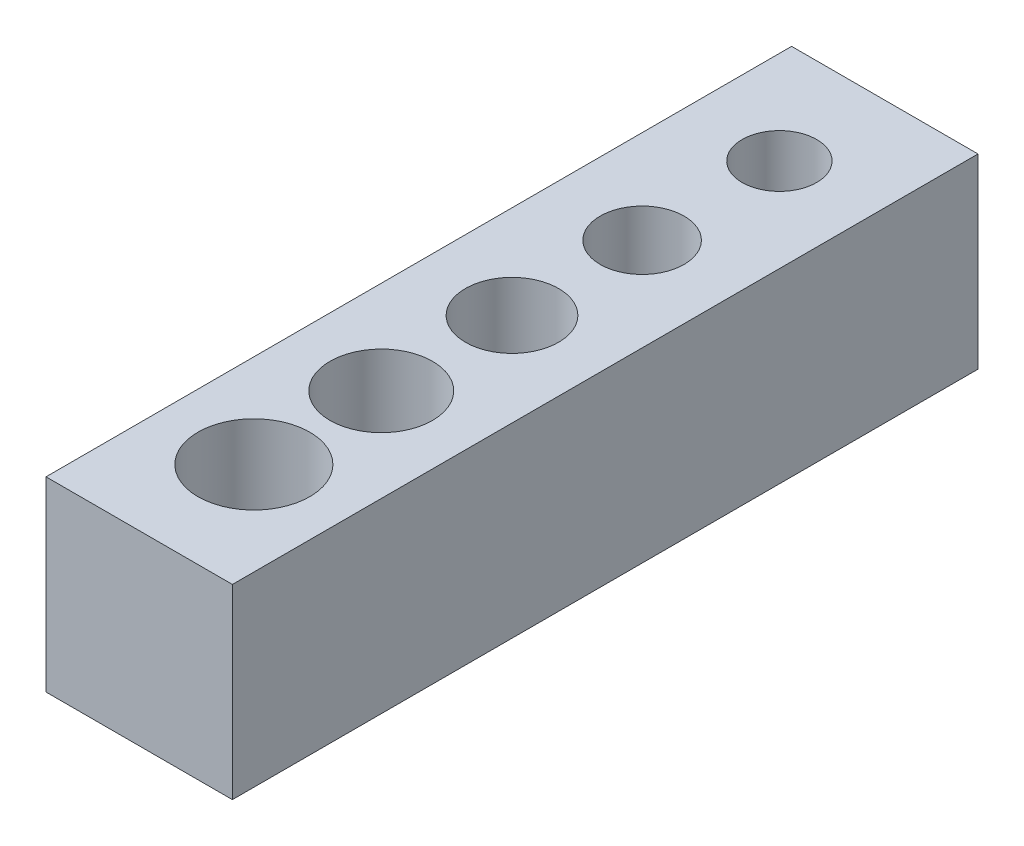
ISO-10303-21;
HEADER;
FILE_DESCRIPTION(('STEP AP214'),'2;1');
FILE_NAME('part.step','',(''),(''),'','','');
FILE_SCHEMA(('AUTOMOTIVE_DESIGN { 1 0 10303 214 1 1 1 1 }'));
ENDSEC;
DATA;
#1=APPLICATION_CONTEXT('core data for automotive mechanical design processes');
#2=APPLICATION_PROTOCOL_DEFINITION('international standard','automotive_design',2000,#1);
#3=PRODUCT_CONTEXT('',#1,'mechanical');
#4=PRODUCT('Part','Part','',(#3));
#5=PRODUCT_RELATED_PRODUCT_CATEGORY('part','',(#4));
#6=PRODUCT_DEFINITION_FORMATION('','',#4);
#7=PRODUCT_DEFINITION_CONTEXT('part definition',#1,'design');
#8=PRODUCT_DEFINITION('design','',#6,#7);
#9=PRODUCT_DEFINITION_SHAPE('','',#8);
#10=(LENGTH_UNIT() NAMED_UNIT(*) SI_UNIT(.MILLI.,.METRE.));
#11=(NAMED_UNIT(*) PLANE_ANGLE_UNIT() SI_UNIT($,.RADIAN.));
#12=(NAMED_UNIT(*) SI_UNIT($,.STERADIAN.) SOLID_ANGLE_UNIT());
#13=UNCERTAINTY_MEASURE_WITH_UNIT(LENGTH_MEASURE(1.E-05),#10,'distance_accuracy_value','');
#14=(GEOMETRIC_REPRESENTATION_CONTEXT(3) GLOBAL_UNCERTAINTY_ASSIGNED_CONTEXT((#13)) GLOBAL_UNIT_ASSIGNED_CONTEXT((#10,
#11,#12)) REPRESENTATION_CONTEXT('',''));
#15=CARTESIAN_POINT('',(0.,0.,0.));
#16=DIRECTION('',(0.,0.,1.));
#17=DIRECTION('',(1.,0.,0.));
#18=AXIS2_PLACEMENT_3D('',#15,#16,#17);
#19=CARTESIAN_POINT('',(0.,10.,0.));
#20=DIRECTION('',(0.,-1.,0.));
#21=DIRECTION('',(0.,0.,-1.));
#22=AXIS2_PLACEMENT_3D('',#19,#20,#21);
#23=PLANE('',#22);
#24=CARTESIAN_POINT('',(0.,10.,-14.3453995567029));
#25=DIRECTION('',(0.,1.,0.));
#26=DIRECTION('',(0.,0.,1.));
#27=AXIS2_PLACEMENT_3D('',#24,#25,#26);
#28=CIRCLE('',#27,2.);
#29=CARTESIAN_POINT('',(0.,10.,-12.3453995567029));
#30=VERTEX_POINT('',#29);
#31=EDGE_CURVE('E129',#30,#30,#28,.T.);
#32=ORIENTED_EDGE('',*,*,#31,.F.);
#33=EDGE_LOOP('',(#32));
#34=FACE_BOUND('',#33,.T.);
#35=CARTESIAN_POINT('',(0.,10.,-6.98108225755334));
#36=DIRECTION('',(0.,1.,0.));
#37=DIRECTION('',(0.,0.,1.));
#38=AXIS2_PLACEMENT_3D('',#35,#36,#37);
#39=CIRCLE('',#38,2.25);
#40=CARTESIAN_POINT('',(0.,10.,-4.73108225755334));
#41=VERTEX_POINT('',#40);
#42=EDGE_CURVE('E117',#41,#41,#39,.T.);
#43=ORIENTED_EDGE('',*,*,#42,.F.);
#44=EDGE_LOOP('',(#43));
#45=FACE_BOUND('',#44,.T.);
#46=DIRECTION('',(0.,0.,-1.));
#47=VECTOR('',#46,1.);
#48=CARTESIAN_POINT('',(5.,10.,20.));
#49=LINE('',#48,#47);
#50=CARTESIAN_POINT('',(5.,10.,20.));
#51=VERTEX_POINT('',#50);
#52=CARTESIAN_POINT('',(5.,10.,-20.));
#53=VERTEX_POINT('',#52);
#54=EDGE_CURVE('E87',#51,#53,#49,.T.);
#55=ORIENTED_EDGE('',*,*,#54,.T.);
#56=DIRECTION('',(-1.,0.,0.));
#57=VECTOR('',#56,1.);
#58=CARTESIAN_POINT('',(-5.,10.,-20.));
#59=LINE('',#58,#57);
#60=CARTESIAN_POINT('',(-5.,10.,-20.));
#61=VERTEX_POINT('',#60);
#62=EDGE_CURVE('E82',#53,#61,#59,.T.);
#63=ORIENTED_EDGE('',*,*,#62,.T.);
#64=DIRECTION('',(0.,0.,1.));
#65=VECTOR('',#64,1.);
#66=CARTESIAN_POINT('',(-5.,10.,20.));
#67=LINE('',#66,#65);
#68=CARTESIAN_POINT('',(-5.,10.,20.));
#69=VERTEX_POINT('',#68);
#70=EDGE_CURVE('E85',#61,#69,#67,.T.);
#71=ORIENTED_EDGE('',*,*,#70,.T.);
#72=DIRECTION('',(1.,0.,0.));
#73=VECTOR('',#72,1.);
#74=CARTESIAN_POINT('',(-5.,10.,20.));
#75=LINE('',#74,#73);
#76=EDGE_CURVE('E52',#69,#51,#75,.T.);
#77=ORIENTED_EDGE('',*,*,#76,.T.);
#78=EDGE_LOOP('',(#55,#63,#71,#77));
#79=FACE_BOUND('',#78,.T.);
#80=CARTESIAN_POINT('',(0.,10.,0.));
#81=DIRECTION('',(0.,1.,0.));
#82=DIRECTION('',(0.,0.,1.));
#83=AXIS2_PLACEMENT_3D('',#80,#81,#82);
#84=CIRCLE('',#83,2.5);
#85=CARTESIAN_POINT('',(0.,10.,2.5));
#86=VERTEX_POINT('',#85);
#87=EDGE_CURVE('E102',#86,#86,#84,.T.);
#88=ORIENTED_EDGE('',*,*,#87,.F.);
#89=EDGE_LOOP('',(#88));
#90=FACE_BOUND('',#89,.T.);
#91=CARTESIAN_POINT('',(0.,10.,7.01390721899031));
#92=DIRECTION('',(0.,1.,0.));
#93=DIRECTION('',(0.,0.,1.));
#94=AXIS2_PLACEMENT_3D('',#91,#92,#93);
#95=CIRCLE('',#94,2.75);
#96=CARTESIAN_POINT('',(0.,10.,9.76390721899031));
#97=VERTEX_POINT('',#96);
#98=EDGE_CURVE('E123',#97,#97,#95,.T.);
#99=ORIENTED_EDGE('',*,*,#98,.F.);
#100=EDGE_LOOP('',(#99));
#101=FACE_BOUND('',#100,.T.);
#102=CARTESIAN_POINT('',(0.,10.,13.8487769285547));
#103=DIRECTION('',(0.,1.,0.));
#104=DIRECTION('',(0.,0.,1.));
#105=AXIS2_PLACEMENT_3D('',#102,#103,#104);
#106=CIRCLE('',#105,3.);
#107=CARTESIAN_POINT('',(0.,10.,16.8487769285547));
#108=VERTEX_POINT('',#107);
#109=EDGE_CURVE('E135',#108,#108,#106,.T.);
#110=ORIENTED_EDGE('',*,*,#109,.F.);
#111=EDGE_LOOP('',(#110));
#112=FACE_BOUND('',#111,.T.);
#113=ADVANCED_FACE('F35',(#34,#45,#79,#90,#101,#112),#23,.F.);
#114=CARTESIAN_POINT('',(0.,0.,0.));
#115=DIRECTION('',(0.,-1.,0.));
#116=DIRECTION('',(0.,0.,-1.));
#117=AXIS2_PLACEMENT_3D('',#114,#115,#116);
#118=PLANE('',#117);
#119=CARTESIAN_POINT('',(0.,0.,-14.3453995567029));
#120=DIRECTION('',(0.,1.,0.));
#121=DIRECTION('',(0.,0.,1.));
#122=AXIS2_PLACEMENT_3D('',#119,#120,#121);
#123=CIRCLE('',#122,2.);
#124=CARTESIAN_POINT('',(0.,0.,-12.3453995567029));
#125=VERTEX_POINT('',#124);
#126=EDGE_CURVE('E132',#125,#125,#123,.T.);
#127=ORIENTED_EDGE('',*,*,#126,.T.);
#128=EDGE_LOOP('',(#127));
#129=FACE_BOUND('',#128,.T.);
#130=CARTESIAN_POINT('',(0.,0.,-6.98108225755334));
#131=DIRECTION('',(0.,1.,0.));
#132=DIRECTION('',(0.,0.,1.));
#133=AXIS2_PLACEMENT_3D('',#130,#131,#132);
#134=CIRCLE('',#133,2.25);
#135=CARTESIAN_POINT('',(0.,0.,-4.73108225755334));
#136=VERTEX_POINT('',#135);
#137=EDGE_CURVE('E120',#136,#136,#134,.T.);
#138=ORIENTED_EDGE('',*,*,#137,.T.);
#139=EDGE_LOOP('',(#138));
#140=FACE_BOUND('',#139,.T.);
#141=DIRECTION('',(0.,0.,-1.));
#142=VECTOR('',#141,1.);
#143=CARTESIAN_POINT('',(5.,0.,20.));
#144=LINE('',#143,#142);
#145=CARTESIAN_POINT('',(5.,0.,20.));
#146=VERTEX_POINT('',#145);
#147=CARTESIAN_POINT('',(5.,0.,-20.));
#148=VERTEX_POINT('',#147);
#149=EDGE_CURVE('E99',#146,#148,#144,.T.);
#150=ORIENTED_EDGE('',*,*,#149,.F.);
#151=DIRECTION('',(1.,0.,0.));
#152=VECTOR('',#151,1.);
#153=CARTESIAN_POINT('',(-5.,0.,20.));
#154=LINE('',#153,#152);
#155=CARTESIAN_POINT('',(-5.,0.,20.));
#156=VERTEX_POINT('',#155);
#157=EDGE_CURVE('E75',#156,#146,#154,.T.);
#158=ORIENTED_EDGE('',*,*,#157,.F.);
#159=DIRECTION('',(0.,0.,1.));
#160=VECTOR('',#159,1.);
#161=CARTESIAN_POINT('',(-5.,0.,20.));
#162=LINE('',#161,#160);
#163=CARTESIAN_POINT('',(-5.,0.,-20.));
#164=VERTEX_POINT('',#163);
#165=EDGE_CURVE('E69',#164,#156,#162,.T.);
#166=ORIENTED_EDGE('',*,*,#165,.F.);
#167=DIRECTION('',(-1.,0.,0.));
#168=VECTOR('',#167,1.);
#169=CARTESIAN_POINT('',(-5.,0.,-20.));
#170=LINE('',#169,#168);
#171=EDGE_CURVE('E91',#148,#164,#170,.T.);
#172=ORIENTED_EDGE('',*,*,#171,.F.);
#173=EDGE_LOOP('',(#150,#158,#166,#172));
#174=FACE_BOUND('',#173,.T.);
#175=CARTESIAN_POINT('',(0.,0.,0.));
#176=DIRECTION('',(0.,1.,0.));
#177=DIRECTION('',(0.,0.,1.));
#178=AXIS2_PLACEMENT_3D('',#175,#176,#177);
#179=CIRCLE('',#178,2.5);
#180=CARTESIAN_POINT('',(0.,0.,2.5));
#181=VERTEX_POINT('',#180);
#182=EDGE_CURVE('E114',#181,#181,#179,.T.);
#183=ORIENTED_EDGE('',*,*,#182,.T.);
#184=EDGE_LOOP('',(#183));
#185=FACE_BOUND('',#184,.T.);
#186=CARTESIAN_POINT('',(0.,0.,7.01390721899031));
#187=DIRECTION('',(0.,1.,0.));
#188=DIRECTION('',(0.,0.,1.));
#189=AXIS2_PLACEMENT_3D('',#186,#187,#188);
#190=CIRCLE('',#189,2.75);
#191=CARTESIAN_POINT('',(0.,0.,9.76390721899031));
#192=VERTEX_POINT('',#191);
#193=EDGE_CURVE('E126',#192,#192,#190,.T.);
#194=ORIENTED_EDGE('',*,*,#193,.T.);
#195=EDGE_LOOP('',(#194));
#196=FACE_BOUND('',#195,.T.);
#197=CARTESIAN_POINT('',(0.,0.,13.8487769285547));
#198=DIRECTION('',(0.,1.,0.));
#199=DIRECTION('',(0.,0.,1.));
#200=AXIS2_PLACEMENT_3D('',#197,#198,#199);
#201=CIRCLE('',#200,3.);
#202=CARTESIAN_POINT('',(0.,0.,16.8487769285547));
#203=VERTEX_POINT('',#202);
#204=EDGE_CURVE('E138',#203,#203,#201,.T.);
#205=ORIENTED_EDGE('',*,*,#204,.T.);
#206=EDGE_LOOP('',(#205));
#207=FACE_BOUND('',#206,.T.);
#208=ADVANCED_FACE('F110',(#129,#140,#174,#185,#196,#207),#118,.T.);
#209=CARTESIAN_POINT('',(5.,10.,20.));
#210=DIRECTION('',(-1.,0.,0.));
#211=DIRECTION('',(0.,0.,1.));
#212=AXIS2_PLACEMENT_3D('',#209,#210,#211);
#213=PLANE('',#212);
#214=ORIENTED_EDGE('',*,*,#149,.T.);
#215=DIRECTION('',(0.,-1.,0.));
#216=VECTOR('',#215,1.);
#217=CARTESIAN_POINT('',(5.,10.,-20.));
#218=LINE('',#217,#216);
#219=EDGE_CURVE('E11',#53,#148,#218,.T.);
#220=ORIENTED_EDGE('',*,*,#219,.F.);
#221=ORIENTED_EDGE('',*,*,#54,.F.);
#222=DIRECTION('',(0.,-1.,0.));
#223=VECTOR('',#222,1.);
#224=CARTESIAN_POINT('',(5.,10.,20.));
#225=LINE('',#224,#223);
#226=EDGE_CURVE('E95',#51,#146,#225,.T.);
#227=ORIENTED_EDGE('',*,*,#226,.T.);
#228=EDGE_LOOP('',(#214,#220,#221,#227));
#229=FACE_BOUND('',#228,.T.);
#230=ADVANCED_FACE('F37',(#229),#213,.F.);
#231=CARTESIAN_POINT('',(-5.,10.,-20.));
#232=DIRECTION('',(0.,0.,1.));
#233=DIRECTION('',(1.,0.,0.));
#234=AXIS2_PLACEMENT_3D('',#231,#232,#233);
#235=PLANE('',#234);
#236=ORIENTED_EDGE('',*,*,#171,.T.);
#237=DIRECTION('',(0.,-1.,0.));
#238=VECTOR('',#237,1.);
#239=CARTESIAN_POINT('',(-5.,10.,-20.));
#240=LINE('',#239,#238);
#241=EDGE_CURVE('E44',#61,#164,#240,.T.);
#242=ORIENTED_EDGE('',*,*,#241,.F.);
#243=ORIENTED_EDGE('',*,*,#62,.F.);
#244=ORIENTED_EDGE('',*,*,#219,.T.);
#245=EDGE_LOOP('',(#236,#242,#243,#244));
#246=FACE_BOUND('',#245,.T.);
#247=ADVANCED_FACE('F90',(#246),#235,.F.);
#248=CARTESIAN_POINT('',(-5.,10.,20.));
#249=DIRECTION('',(1.,0.,0.));
#250=DIRECTION('',(0.,0.,-1.));
#251=AXIS2_PLACEMENT_3D('',#248,#249,#250);
#252=PLANE('',#251);
#253=ORIENTED_EDGE('',*,*,#165,.T.);
#254=DIRECTION('',(0.,-1.,0.));
#255=VECTOR('',#254,1.);
#256=CARTESIAN_POINT('',(-5.,10.,20.));
#257=LINE('',#256,#255);
#258=EDGE_CURVE('E92',#69,#156,#257,.T.);
#259=ORIENTED_EDGE('',*,*,#258,.F.);
#260=ORIENTED_EDGE('',*,*,#70,.F.);
#261=ORIENTED_EDGE('',*,*,#241,.T.);
#262=EDGE_LOOP('',(#253,#259,#260,#261));
#263=FACE_BOUND('',#262,.T.);
#264=ADVANCED_FACE('F93',(#263),#252,.F.);
#265=CARTESIAN_POINT('',(-5.,10.,20.));
#266=DIRECTION('',(0.,0.,-1.));
#267=DIRECTION('',(-1.,0.,0.));
#268=AXIS2_PLACEMENT_3D('',#265,#266,#267);
#269=PLANE('',#268);
#270=ORIENTED_EDGE('',*,*,#157,.T.);
#271=ORIENTED_EDGE('',*,*,#226,.F.);
#272=ORIENTED_EDGE('',*,*,#76,.F.);
#273=ORIENTED_EDGE('',*,*,#258,.T.);
#274=EDGE_LOOP('',(#270,#271,#272,#273));
#275=FACE_BOUND('',#274,.T.);
#276=ADVANCED_FACE('F107',(#275),#269,.F.);
#277=CARTESIAN_POINT('',(0.,10.,0.));
#278=DIRECTION('',(0.,-1.,0.));
#279=DIRECTION('',(0.,0.,-1.));
#280=AXIS2_PLACEMENT_3D('',#277,#278,#279);
#281=CYLINDRICAL_SURFACE('',#280,2.5);
#282=ORIENTED_EDGE('',*,*,#87,.T.);
#283=EDGE_LOOP('',(#282));
#284=FACE_BOUND('',#283,.T.);
#285=ORIENTED_EDGE('',*,*,#182,.F.);
#286=EDGE_LOOP('',(#285));
#287=FACE_BOUND('',#286,.T.);
#288=ADVANCED_FACE('F158',(#284,#287),#281,.F.);
#289=CARTESIAN_POINT('',(0.,10.,-6.98108225755334));
#290=DIRECTION('',(0.,-1.,0.));
#291=DIRECTION('',(0.,0.,-1.));
#292=AXIS2_PLACEMENT_3D('',#289,#290,#291);
#293=CYLINDRICAL_SURFACE('',#292,2.25);
#294=ORIENTED_EDGE('',*,*,#42,.T.);
#295=EDGE_LOOP('',(#294));
#296=FACE_BOUND('',#295,.T.);
#297=ORIENTED_EDGE('',*,*,#137,.F.);
#298=EDGE_LOOP('',(#297));
#299=FACE_BOUND('',#298,.T.);
#300=ADVANCED_FACE('F204',(#296,#299),#293,.F.);
#301=CARTESIAN_POINT('',(0.,10.,7.01390721899031));
#302=DIRECTION('',(0.,-1.,0.));
#303=DIRECTION('',(0.,0.,-1.));
#304=AXIS2_PLACEMENT_3D('',#301,#302,#303);
#305=CYLINDRICAL_SURFACE('',#304,2.75);
#306=ORIENTED_EDGE('',*,*,#98,.T.);
#307=EDGE_LOOP('',(#306));
#308=FACE_BOUND('',#307,.T.);
#309=ORIENTED_EDGE('',*,*,#193,.F.);
#310=EDGE_LOOP('',(#309));
#311=FACE_BOUND('',#310,.T.);
#312=ADVANCED_FACE('F212',(#308,#311),#305,.F.);
#313=CARTESIAN_POINT('',(0.,10.,-14.3453995567029));
#314=DIRECTION('',(0.,-1.,0.));
#315=DIRECTION('',(0.,0.,-1.));
#316=AXIS2_PLACEMENT_3D('',#313,#314,#315);
#317=CYLINDRICAL_SURFACE('',#316,2.);
#318=ORIENTED_EDGE('',*,*,#31,.T.);
#319=EDGE_LOOP('',(#318));
#320=FACE_BOUND('',#319,.T.);
#321=ORIENTED_EDGE('',*,*,#126,.F.);
#322=EDGE_LOOP('',(#321));
#323=FACE_BOUND('',#322,.T.);
#324=ADVANCED_FACE('F220',(#320,#323),#317,.F.);
#325=CARTESIAN_POINT('',(0.,10.,13.8487769285547));
#326=DIRECTION('',(0.,-1.,0.));
#327=DIRECTION('',(0.,0.,-1.));
#328=AXIS2_PLACEMENT_3D('',#325,#326,#327);
#329=CYLINDRICAL_SURFACE('',#328,3.);
#330=ORIENTED_EDGE('',*,*,#109,.T.);
#331=EDGE_LOOP('',(#330));
#332=FACE_BOUND('',#331,.T.);
#333=ORIENTED_EDGE('',*,*,#204,.F.);
#334=EDGE_LOOP('',(#333));
#335=FACE_BOUND('',#334,.T.);
#336=ADVANCED_FACE('F144',(#332,#335),#329,.F.);
#337=CLOSED_SHELL('',(#113,#208,#230,#247,#264,#276,#288,#300,#312,#324,#336));
#338=MANIFOLD_SOLID_BREP('B2',#337);
#339=ADVANCED_BREP_SHAPE_REPRESENTATION('',(#18,#338),#14);
#340=SHAPE_DEFINITION_REPRESENTATION(#9,#339);
ENDSEC;
END-ISO-10303-21;
